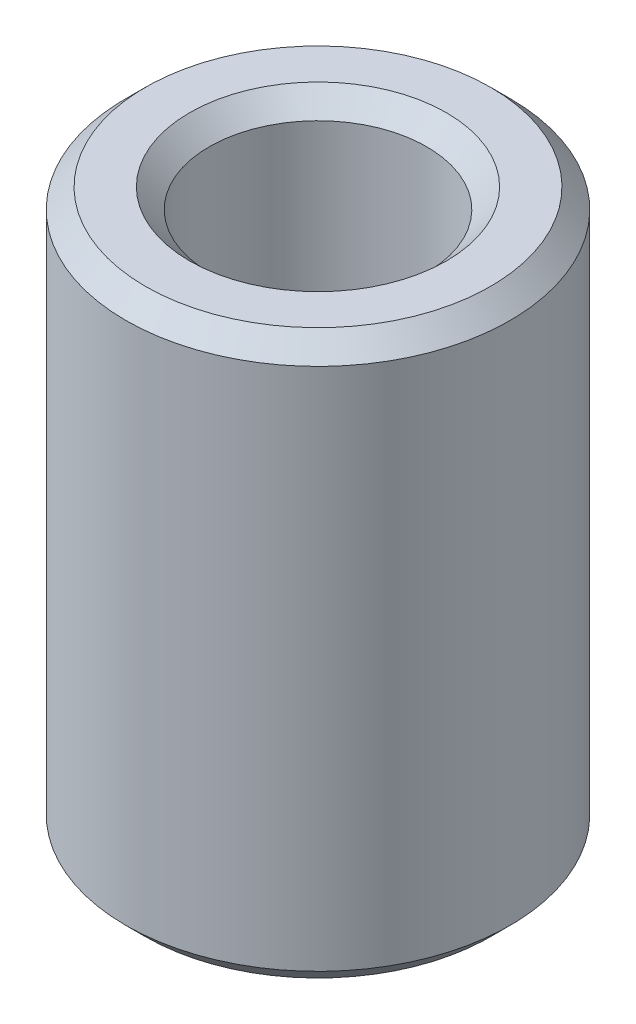
ISO-10303-21;
HEADER;
FILE_DESCRIPTION(('STEP AP214'),'2;1');
FILE_NAME('part.step','',(''),(''),'','','');
FILE_SCHEMA(('AUTOMOTIVE_DESIGN { 1 0 10303 214 1 1 1 1 }'));
ENDSEC;
DATA;
#1=APPLICATION_CONTEXT('core data for automotive mechanical design processes');
#2=APPLICATION_PROTOCOL_DEFINITION('international standard','automotive_design',2000,#1);
#3=PRODUCT_CONTEXT('',#1,'mechanical');
#4=PRODUCT('Part','Part','',(#3));
#5=PRODUCT_RELATED_PRODUCT_CATEGORY('part','',(#4));
#6=PRODUCT_DEFINITION_FORMATION('','',#4);
#7=PRODUCT_DEFINITION_CONTEXT('part definition',#1,'design');
#8=PRODUCT_DEFINITION('design','',#6,#7);
#9=PRODUCT_DEFINITION_SHAPE('','',#8);
#10=(LENGTH_UNIT() NAMED_UNIT(*) SI_UNIT(.MILLI.,.METRE.));
#11=(NAMED_UNIT(*) PLANE_ANGLE_UNIT() SI_UNIT($,.RADIAN.));
#12=(NAMED_UNIT(*) SI_UNIT($,.STERADIAN.) SOLID_ANGLE_UNIT());
#13=UNCERTAINTY_MEASURE_WITH_UNIT(LENGTH_MEASURE(1.E-05),#10,'distance_accuracy_value','');
#14=(GEOMETRIC_REPRESENTATION_CONTEXT(3) GLOBAL_UNCERTAINTY_ASSIGNED_CONTEXT((#13)) GLOBAL_UNIT_ASSIGNED_CONTEXT((#10,
#11,#12)) REPRESENTATION_CONTEXT('',''));
#15=CARTESIAN_POINT('',(0.,0.,0.));
#16=DIRECTION('',(0.,0.,1.));
#17=DIRECTION('',(1.,0.,0.));
#18=AXIS2_PLACEMENT_3D('',#15,#16,#17);
#19=CARTESIAN_POINT('',(0.,80.5957418697602,0.));
#20=DIRECTION('',(0.,-1.,0.));
#21=DIRECTION('',(0.,0.,-1.));
#22=AXIS2_PLACEMENT_3D('',#19,#20,#21);
#23=CYLINDRICAL_SURFACE('',#22,27.5);
#24=CARTESIAN_POINT('',(0.,2.81266062594676,0.));
#25=DIRECTION('',(0.,1.,0.));
#26=DIRECTION('',(0.,0.,1.));
#27=AXIS2_PLACEMENT_3D('',#24,#25,#26);
#28=CIRCLE('',#27,27.5);
#29=CARTESIAN_POINT('',(0.,2.81266062594676,27.5));
#30=VERTEX_POINT('',#29);
#31=EDGE_CURVE('E10',#30,#30,#28,.T.);
#32=ORIENTED_EDGE('',*,*,#31,.T.);
#33=EDGE_LOOP('',(#32));
#34=FACE_BOUND('',#33,.T.);
#35=CARTESIAN_POINT('',(0.,77.7830812438134,0.));
#36=DIRECTION('',(0.,1.,0.));
#37=DIRECTION('',(0.,0.,1.));
#38=AXIS2_PLACEMENT_3D('',#35,#36,#37);
#39=CIRCLE('',#38,27.5);
#40=CARTESIAN_POINT('',(0.,77.7830812438134,27.5));
#41=VERTEX_POINT('',#40);
#42=EDGE_CURVE('E50',#41,#41,#39,.F.);
#43=ORIENTED_EDGE('',*,*,#42,.T.);
#44=EDGE_LOOP('',(#43));
#45=FACE_BOUND('',#44,.T.);
#46=ADVANCED_FACE('F39',(#34,#45),#23,.T.);
#47=CARTESIAN_POINT('',(0.,80.5957418697602,0.));
#48=DIRECTION('',(0.,1.,0.));
#49=DIRECTION('',(0.,0.,1.));
#50=AXIS2_PLACEMENT_3D('',#47,#48,#49);
#51=PLANE('',#50);
#52=CARTESIAN_POINT('',(0.,80.5957418697602,0.));
#53=DIRECTION('',(0.,1.,0.));
#54=DIRECTION('',(0.,0.,1.));
#55=AXIS2_PLACEMENT_3D('',#52,#53,#54);
#56=CIRCLE('',#55,18.3782316604595);
#57=CARTESIAN_POINT('',(0.,80.5957418697602,18.3782316604595));
#58=VERTEX_POINT('',#57);
#59=EDGE_CURVE('E58',#58,#58,#56,.F.);
#60=ORIENTED_EDGE('',*,*,#59,.T.);
#61=EDGE_LOOP('',(#60));
#62=FACE_BOUND('',#61,.T.);
#63=CARTESIAN_POINT('',(0.,80.5957418697602,0.));
#64=DIRECTION('',(0.,1.,0.));
#65=DIRECTION('',(0.,0.,1.));
#66=AXIS2_PLACEMENT_3D('',#63,#64,#65);
#67=CIRCLE('',#66,24.6873393740532);
#68=CARTESIAN_POINT('',(0.,80.5957418697602,24.6873393740532));
#69=VERTEX_POINT('',#68);
#70=EDGE_CURVE('E61',#69,#69,#67,.T.);
#71=ORIENTED_EDGE('',*,*,#70,.T.);
#72=EDGE_LOOP('',(#71));
#73=FACE_BOUND('',#72,.T.);
#74=ADVANCED_FACE('F88',(#62,#73),#51,.T.);
#75=CARTESIAN_POINT('',(0.,0.,0.));
#76=DIRECTION('',(0.,1.,0.));
#77=DIRECTION('',(0.,0.,1.));
#78=AXIS2_PLACEMENT_3D('',#75,#76,#77);
#79=PLANE('',#78);
#80=CARTESIAN_POINT('',(0.,0.,0.));
#81=DIRECTION('',(0.,1.,0.));
#82=DIRECTION('',(0.,0.,1.));
#83=AXIS2_PLACEMENT_3D('',#80,#81,#82);
#84=CIRCLE('',#83,18.3782316604595);
#85=CARTESIAN_POINT('',(0.,0.,18.3782316604595));
#86=VERTEX_POINT('',#85);
#87=EDGE_CURVE('E51',#86,#86,#84,.T.);
#88=ORIENTED_EDGE('',*,*,#87,.T.);
#89=EDGE_LOOP('',(#88));
#90=FACE_BOUND('',#89,.T.);
#91=CARTESIAN_POINT('',(0.,0.,0.));
#92=DIRECTION('',(0.,1.,0.));
#93=DIRECTION('',(0.,0.,1.));
#94=AXIS2_PLACEMENT_3D('',#91,#92,#93);
#95=CIRCLE('',#94,24.6873393740532);
#96=CARTESIAN_POINT('',(0.,0.,24.6873393740532));
#97=VERTEX_POINT('',#96);
#98=EDGE_CURVE('E54',#97,#97,#95,.F.);
#99=ORIENTED_EDGE('',*,*,#98,.T.);
#100=EDGE_LOOP('',(#99));
#101=FACE_BOUND('',#100,.T.);
#102=ADVANCED_FACE('F83',(#90,#101),#79,.F.);
#103=CARTESIAN_POINT('',(0.,80.5957418697602,0.));
#104=DIRECTION('',(0.,-1.,0.));
#105=DIRECTION('',(0.,0.,-1.));
#106=AXIS2_PLACEMENT_3D('',#103,#104,#105);
#107=CYLINDRICAL_SURFACE('',#106,15.5655710345128);
#108=CARTESIAN_POINT('',(0.,77.7830812438135,0.));
#109=DIRECTION('',(0.,1.,0.));
#110=DIRECTION('',(0.,0.,1.));
#111=AXIS2_PLACEMENT_3D('',#108,#109,#110);
#112=CIRCLE('',#111,15.5655710345128);
#113=CARTESIAN_POINT('',(0.,77.7830812438135,15.5655710345128));
#114=VERTEX_POINT('',#113);
#115=EDGE_CURVE('E67',#114,#114,#112,.T.);
#116=ORIENTED_EDGE('',*,*,#115,.T.);
#117=EDGE_LOOP('',(#116));
#118=FACE_BOUND('',#117,.T.);
#119=CARTESIAN_POINT('',(0.,2.81266062594678,0.));
#120=DIRECTION('',(0.,1.,0.));
#121=DIRECTION('',(0.,0.,1.));
#122=AXIS2_PLACEMENT_3D('',#119,#120,#121);
#123=CIRCLE('',#122,15.5655710345128);
#124=CARTESIAN_POINT('',(0.,2.81266062594678,15.5655710345128));
#125=VERTEX_POINT('',#124);
#126=EDGE_CURVE('E69',#125,#125,#123,.F.);
#127=ORIENTED_EDGE('',*,*,#126,.T.);
#128=EDGE_LOOP('',(#127));
#129=FACE_BOUND('',#128,.T.);
#130=ADVANCED_FACE('F71',(#118,#129),#107,.F.);
#131=CARTESIAN_POINT('',(0.,77.7830812438135,0.));
#132=DIRECTION('',(0.,1.,0.));
#133=DIRECTION('',(0.,0.,1.));
#134=AXIS2_PLACEMENT_3D('',#131,#132,#133);
#135=CONICAL_SURFACE('',#134,15.5655710345128,0.785398163397454);
#136=CARTESIAN_POINT('',(0.,80.5957418697602,18.3782316604595));
#137=CARTESIAN_POINT('',(0.,80.5664433215733,18.3489331122726));
#138=CARTESIAN_POINT('',(0.,80.5371447733863,18.3196345640856));
#139=CARTESIAN_POINT('',(0.,80.4785476770124,18.2610374677118));
#140=CARTESIAN_POINT('',(0.,80.4492491288255,18.2317389195248));
#141=CARTESIAN_POINT('',(0.,80.3906520324516,18.1731418231509));
#142=CARTESIAN_POINT('',(0.,80.3613534842647,18.143843274964));
#143=CARTESIAN_POINT('',(0.,80.3027563878908,18.0852461785901));
#144=CARTESIAN_POINT('',(0.,80.2734578397038,18.0559476304031));
#145=CARTESIAN_POINT('',(0.,80.2148607433299,17.9973505340292));
#146=CARTESIAN_POINT('',(0.,80.185562195143,17.9680519858423));
#147=CARTESIAN_POINT('',(0.,80.1269650987691,17.9094548894684));
#148=CARTESIAN_POINT('',(0.,80.0976665505821,17.8801563412815));
#149=CARTESIAN_POINT('',(0.,80.0390694542082,17.8215592449076));
#150=CARTESIAN_POINT('',(0.,80.0097709060213,17.7922606967206));
#151=CARTESIAN_POINT('',(0.,79.9511738096474,17.7336636003467));
#152=CARTESIAN_POINT('',(0.,79.9218752614605,17.7043650521598));
#153=CARTESIAN_POINT('',(0.,79.8632781650866,17.6457679557859));
#154=CARTESIAN_POINT('',(0.,79.8339796168996,17.6164694075989));
#155=CARTESIAN_POINT('',(0.,79.7753825205257,17.5578723112251));
#156=CARTESIAN_POINT('',(0.,79.7460839723388,17.5285737630381));
#157=CARTESIAN_POINT('',(0.,79.6874868759649,17.4699766666642));
#158=CARTESIAN_POINT('',(0.,79.658188327778,17.4406781184773));
#159=CARTESIAN_POINT('',(0.,79.5995912314041,17.3820810221034));
#160=CARTESIAN_POINT('',(0.,79.5702926832171,17.3527824739164));
#161=CARTESIAN_POINT('',(0.,79.5116955868432,17.2941853775426));
#162=CARTESIAN_POINT('',(0.,79.4823970386563,17.2648868293556));
#163=CARTESIAN_POINT('',(0.,79.4237999422824,17.2062897329817));
#164=CARTESIAN_POINT('',(0.,79.3945013940955,17.1769911847948));
#165=CARTESIAN_POINT('',(0.,79.3359042977216,17.1183940884209));
#166=CARTESIAN_POINT('',(0.,79.3066057495346,17.0890955402339));
#167=CARTESIAN_POINT('',(0.,79.2480086531607,17.03049844386));
#168=CARTESIAN_POINT('',(0.,79.2187101049738,17.0011998956731));
#169=CARTESIAN_POINT('',(0.,79.1601130085999,16.9426027992992));
#170=CARTESIAN_POINT('',(0.,79.1308144604129,16.9133042511123));
#171=CARTESIAN_POINT('',(0.,79.0722173640391,16.8547071547384));
#172=CARTESIAN_POINT('',(0.,79.0429188158521,16.8254086065514));
#173=CARTESIAN_POINT('',(0.,78.9843217194782,16.7668115101775));
#174=CARTESIAN_POINT('',(0.,78.9550231712913,16.7375129619906));
#175=CARTESIAN_POINT('',(0.,78.8964260749174,16.6789158656167));
#176=CARTESIAN_POINT('',(0.,78.8671275267304,16.6496173174297));
#177=CARTESIAN_POINT('',(0.,78.8085304303565,16.5910202210559));
#178=CARTESIAN_POINT('',(0.,78.7792318821696,16.5617216728689));
#179=CARTESIAN_POINT('',(0.,78.7206347857957,16.503124576495));
#180=CARTESIAN_POINT('',(0.,78.6913362376088,16.4738260283081));
#181=CARTESIAN_POINT('',(0.,78.6327391412349,16.4152289319342));
#182=CARTESIAN_POINT('',(0.,78.6034405930479,16.3859303837472));
#183=CARTESIAN_POINT('',(0.,78.544843496674,16.3273332873733));
#184=CARTESIAN_POINT('',(0.,78.5155449484871,16.2980347391864));
#185=CARTESIAN_POINT('',(0.,78.4569478521132,16.2394376428125));
#186=CARTESIAN_POINT('',(0.,78.4276493039263,16.2101390946256));
#187=CARTESIAN_POINT('',(0.,78.3690522075524,16.1515419982517));
#188=CARTESIAN_POINT('',(0.,78.3397536593654,16.1222434500647));
#189=CARTESIAN_POINT('',(0.,78.2811565629915,16.0636463536908));
#190=CARTESIAN_POINT('',(0.,78.2518580148046,16.0343478055039));
#191=CARTESIAN_POINT('',(0.,78.1932609184307,15.97575070913));
#192=CARTESIAN_POINT('',(0.,78.1639623702438,15.946452160943));
#193=CARTESIAN_POINT('',(0.,78.1053652738699,15.8878550645692));
#194=CARTESIAN_POINT('',(0.,78.0760667256829,15.8585565163822));
#195=CARTESIAN_POINT('',(0.,78.017469629309,15.7999594200083));
#196=CARTESIAN_POINT('',(0.,77.9881710811221,15.7706608718214));
#197=CARTESIAN_POINT('',(0.,77.9295739847482,15.7120637754475));
#198=CARTESIAN_POINT('',(0.,77.9002754365612,15.6827652272605));
#199=CARTESIAN_POINT('',(0.,77.8416783401874,15.6241681308866));
#200=CARTESIAN_POINT('',(0.,77.8123797920004,15.5948695826997));
#201=CARTESIAN_POINT('',(0.,77.7830812438135,15.5655710345128));
#202=B_SPLINE_CURVE_WITH_KNOTS('',3,(#136,#137,#138,#139,#140,#141,#142,#143,#144,#145,#146,
#147,#148,#149,#150,#151,#152,#153,#154,#155,#156,#157,#158,#159,#160,#161,#162,#163,#164,#165,
#166,#167,#168,#169,#170,#171,#172,#173,#174,#175,#176,#177,#178,#179,#180,#181,#182,#183,#184,
#185,#186,#187,#188,#189,#190,#191,#192,#193,#194,#195,#196,#197,#198,#199,#200,#201),
.UNSPECIFIED.,.F.,.F.,(4,2,2,2,2,2,2,2,2,2,2,2,2,2,2,2,2,2,2,2,2,2,2,2,2,2,2,2,2,2,2,2,4),(0.,
0.124303212611462,0.248606425222924,0.372909637834386,0.497212850445839,0.621516063057303,
0.745819275668765,0.870122488280228,0.99442570089168,1.11872891350314,1.24303212611461,
1.36733533872606,1.49163855133752,1.61594176394898,1.74024497656045,1.8645481891719,
1.98885140178336,2.11315461439482,2.23745782700628,2.36176103961774,2.4860642522292,
2.61036746484066,2.73467067745212,2.85897389006358,2.98327710267504,3.1075803152865,
3.23188352789796,3.35618674050942,3.48048995312088,3.60479316573233,3.7290963783438,
3.85339959095526,3.97770280356671),.UNSPECIFIED.);
#203=EDGE_CURVE('BSEAM77',#58,#114,#202,.T.);
#204=ORIENTED_EDGE('',*,*,#59,.F.);
#205=ORIENTED_EDGE('',*,*,#115,.F.);
#206=ORIENTED_EDGE('',*,*,#203,.T.);
#207=ORIENTED_EDGE('',*,*,#203,.F.);
#208=EDGE_LOOP('',(#204,#206,#205,#207));
#209=FACE_BOUND('',#208,.T.);
#210=ADVANCED_FACE('F77',(#209),#135,.F.);
#211=CARTESIAN_POINT('',(0.,0.,0.));
#212=DIRECTION('',(0.,-1.,0.));
#213=DIRECTION('',(0.,0.,-1.));
#214=AXIS2_PLACEMENT_3D('',#211,#212,#213);
#215=CONICAL_SURFACE('',#214,18.3782316604595,0.785398163397445);
#216=ORIENTED_EDGE('',*,*,#126,.F.);
#217=EDGE_LOOP('',(#216));
#218=FACE_BOUND('',#217,.T.);
#219=ORIENTED_EDGE('',*,*,#87,.F.);
#220=EDGE_LOOP('',(#219));
#221=FACE_BOUND('',#220,.T.);
#222=ADVANCED_FACE('F73',(#218,#221),#215,.F.);
#223=CARTESIAN_POINT('',(0.,2.81266062594676,0.));
#224=DIRECTION('',(0.,1.,0.));
#225=DIRECTION('',(0.,0.,1.));
#226=AXIS2_PLACEMENT_3D('',#223,#224,#225);
#227=CONICAL_SURFACE('',#226,27.5,0.785398163397454);
#228=ORIENTED_EDGE('',*,*,#98,.F.);
#229=EDGE_LOOP('',(#228));
#230=FACE_BOUND('',#229,.T.);
#231=ORIENTED_EDGE('',*,*,#31,.F.);
#232=EDGE_LOOP('',(#231));
#233=FACE_BOUND('',#232,.T.);
#234=ADVANCED_FACE('F76',(#230,#233),#227,.T.);
#235=CARTESIAN_POINT('',(0.,80.5957418697602,0.));
#236=DIRECTION('',(0.,-1.,0.));
#237=DIRECTION('',(0.,0.,-1.));
#238=AXIS2_PLACEMENT_3D('',#235,#236,#237);
#239=CONICAL_SURFACE('',#238,24.6873393740532,0.785398163397445);
#240=ORIENTED_EDGE('',*,*,#42,.F.);
#241=EDGE_LOOP('',(#240));
#242=FACE_BOUND('',#241,.T.);
#243=ORIENTED_EDGE('',*,*,#70,.F.);
#244=EDGE_LOOP('',(#243));
#245=FACE_BOUND('',#244,.T.);
#246=ADVANCED_FACE('F45',(#242,#245),#239,.T.);
#247=CLOSED_SHELL('',(#46,#74,#102,#130,#210,#222,#234,#246));
#248=MANIFOLD_SOLID_BREP('B2',#247);
#249=ADVANCED_BREP_SHAPE_REPRESENTATION('',(#18,#248),#14);
#250=SHAPE_DEFINITION_REPRESENTATION(#9,#249);
ENDSEC;
END-ISO-10303-21;
